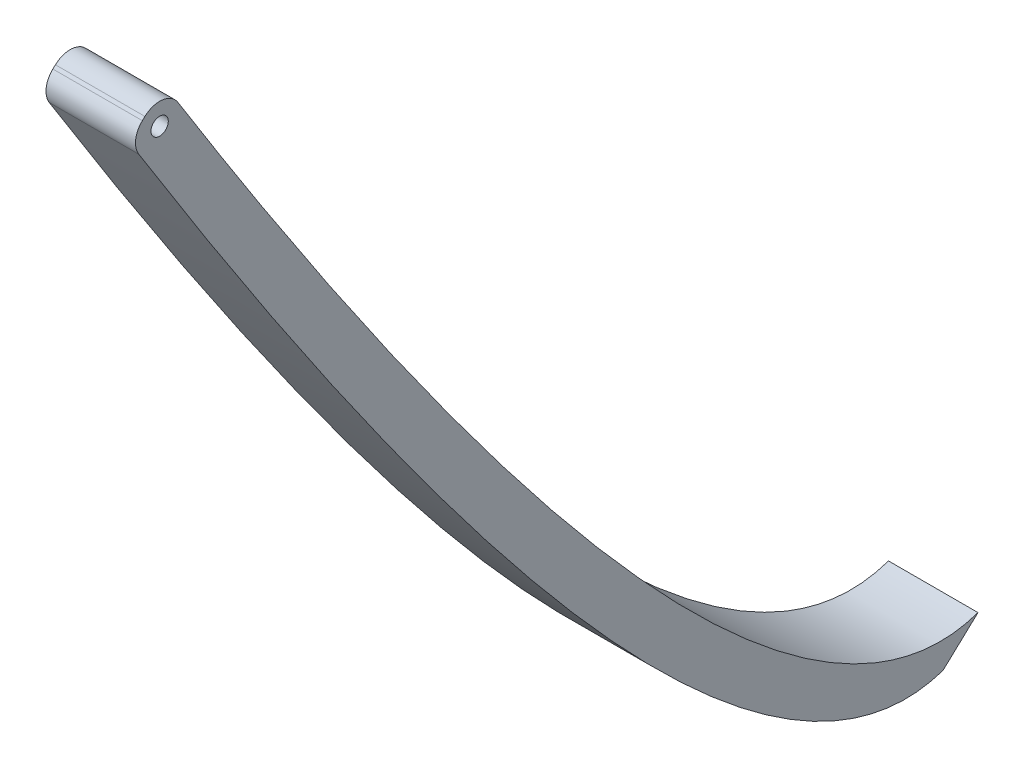
ISO-10303-21;
HEADER;
FILE_DESCRIPTION(('STEP AP214'),'2;1');
FILE_NAME('part.step','',(''),(''),'','','');
FILE_SCHEMA(('AUTOMOTIVE_DESIGN { 1 0 10303 214 1 1 1 1 }'));
ENDSEC;
DATA;
#1=APPLICATION_CONTEXT('core data for automotive mechanical design processes');
#2=APPLICATION_PROTOCOL_DEFINITION('international standard','automotive_design',2000,#1);
#3=PRODUCT_CONTEXT('',#1,'mechanical');
#4=PRODUCT('Part','Part','',(#3));
#5=PRODUCT_RELATED_PRODUCT_CATEGORY('part','',(#4));
#6=PRODUCT_DEFINITION_FORMATION('','',#4);
#7=PRODUCT_DEFINITION_CONTEXT('part definition',#1,'design');
#8=PRODUCT_DEFINITION('design','',#6,#7);
#9=PRODUCT_DEFINITION_SHAPE('','',#8);
#10=(LENGTH_UNIT() NAMED_UNIT(*) SI_UNIT(.MILLI.,.METRE.));
#11=(NAMED_UNIT(*) PLANE_ANGLE_UNIT() SI_UNIT($,.RADIAN.));
#12=(NAMED_UNIT(*) SI_UNIT($,.STERADIAN.) SOLID_ANGLE_UNIT());
#13=UNCERTAINTY_MEASURE_WITH_UNIT(LENGTH_MEASURE(1.E-05),#10,'distance_accuracy_value','');
#14=(GEOMETRIC_REPRESENTATION_CONTEXT(3) GLOBAL_UNCERTAINTY_ASSIGNED_CONTEXT((#13)) GLOBAL_UNIT_ASSIGNED_CONTEXT((#10,
#11,#12)) REPRESENTATION_CONTEXT('',''));
#15=CARTESIAN_POINT('',(0.,0.,0.));
#16=DIRECTION('',(0.,0.,1.));
#17=DIRECTION('',(1.,0.,0.));
#18=AXIS2_PLACEMENT_3D('',#15,#16,#17);
#19=CARTESIAN_POINT('',(10.52068,-1.78849990373209E-12,-1.12800394025392E-12));
#20=CARTESIAN_POINT('',(10.52068,-110.968732872422,-68.8329647294172));
#21=CARTESIAN_POINT('',(10.52068,-101.600000000002,-95.6940061903301));
#22=B_SPLINE_CURVE_WITH_KNOTS('',2,(#19,#20,#21),.UNSPECIFIED.,.F.,.F.,(3,3),
(0.0468869322633743,0.913353357478369),.UNSPECIFIED.);
#23=DIRECTION('',(-1.,0.,0.));
#24=VECTOR('',#23,1.);
#25=SURFACE_OF_LINEAR_EXTRUSION('',#22,#24);
#26=CARTESIAN_POINT('',(10.52068,-1.77682253678522,-1.1042604946298));
#27=VERTEX_POINT('',#26);
#28=CARTESIAN_POINT('',(10.52068,-101.6,-95.6940061903296));
#29=VERTEX_POINT('',#28);
#30=EDGE_CURVE('E94',#27,#29,#22,.T.);
#31=ORIENTED_EDGE('',*,*,#30,.F.);
#32=DIRECTION('',(-1.,0.,0.));
#33=VECTOR('',#32,1.);
#34=CARTESIAN_POINT('',(10.52068,-1.77682253678526,-1.10426049462983));
#35=LINE('',#34,#33);
#36=CARTESIAN_POINT('',(0.,-1.77682253678522,-1.1042604946298));
#37=VERTEX_POINT('',#36);
#38=EDGE_CURVE('E120',#27,#37,#35,.T.);
#39=ORIENTED_EDGE('',*,*,#38,.T.);
#40=CARTESIAN_POINT('',(0.,-1.78849990373209E-12,-1.12800394025392E-12));
#41=CARTESIAN_POINT('',(0.,-110.968732872422,-68.8329647294172));
#42=CARTESIAN_POINT('',(0.,-101.600000000002,-95.6940061903301));
#43=B_SPLINE_CURVE_WITH_KNOTS('',2,(#40,#41,#42),.UNSPECIFIED.,.F.,.F.,(3,3),
(0.0468869322633743,0.913353357478369),.UNSPECIFIED.);
#44=CARTESIAN_POINT('',(0.,-101.6,-95.6940061903296));
#45=VERTEX_POINT('',#44);
#46=EDGE_CURVE('E117',#37,#45,#43,.T.);
#47=ORIENTED_EDGE('',*,*,#46,.T.);
#48=DIRECTION('',(-1.,0.,0.));
#49=VECTOR('',#48,1.);
#50=CARTESIAN_POINT('',(10.52068,-101.6,-95.6940061903296));
#51=LINE('',#50,#49);
#52=EDGE_CURVE('E110',#29,#45,#51,.T.);
#53=ORIENTED_EDGE('',*,*,#52,.F.);
#54=EDGE_LOOP('',(#31,#39,#47,#53));
#55=FACE_BOUND('',#54,.T.);
#56=ADVANCED_FACE('F39',(#55),#25,.F.);
#57=CARTESIAN_POINT('',(10.52068,-101.6,-95.6940061903296));
#58=DIRECTION('',(0.,0.73173678836011,0.681587318368257));
#59=DIRECTION('',(0.,-0.681587318368257,0.73173678836011));
#60=AXIS2_PLACEMENT_3D('',#57,#58,#59);
#61=PLANE('',#60);
#62=DIRECTION('',(0.,0.681587318368257,-0.73173678836011));
#63=VECTOR('',#62,1.);
#64=CARTESIAN_POINT('',(0.,-101.6,-95.6940061903296));
#65=LINE('',#64,#63);
#66=CARTESIAN_POINT('',(0.,-97.7912900649608,-99.7829513636856));
#67=VERTEX_POINT('',#66);
#68=EDGE_CURVE('E157',#45,#67,#65,.T.);
#69=ORIENTED_EDGE('',*,*,#68,.T.);
#70=DIRECTION('',(-1.,0.,0.));
#71=VECTOR('',#70,1.);
#72=CARTESIAN_POINT('',(10.52068,-97.7912900649608,-99.7829513636856));
#73=LINE('',#72,#71);
#74=CARTESIAN_POINT('',(10.52068,-97.7912900649608,-99.7829513636856));
#75=VERTEX_POINT('',#74);
#76=EDGE_CURVE('E112',#75,#67,#73,.T.);
#77=ORIENTED_EDGE('',*,*,#76,.F.);
#78=DIRECTION('',(0.,0.681587318368257,-0.73173678836011));
#79=VECTOR('',#78,1.);
#80=CARTESIAN_POINT('',(10.52068,-101.6,-95.6940061903296));
#81=LINE('',#80,#79);
#82=EDGE_CURVE('E97',#29,#75,#81,.T.);
#83=ORIENTED_EDGE('',*,*,#82,.F.);
#84=ORIENTED_EDGE('',*,*,#52,.T.);
#85=EDGE_LOOP('',(#69,#77,#83,#84));
#86=FACE_BOUND('',#85,.T.);
#87=ADVANCED_FACE('F109',(#86),#61,.F.);
#88=CARTESIAN_POINT('',(10.52068,-97.7912900649608,-99.7829513636856));
#89=CARTESIAN_POINT('',(10.52068,-107.16002293738,-72.9219099027734));
#90=CARTESIAN_POINT('',(10.52068,3.80870993503443,-4.08894517336165));
#91=B_SPLINE_CURVE_WITH_KNOTS('',2,(#88,#89,#90),.UNSPECIFIED.,.F.,.F.,(3,3),
(0.0468869322633991,0.913353357478373),.UNSPECIFIED.);
#92=DIRECTION('',(-1.,0.,0.));
#93=VECTOR('',#92,1.);
#94=SURFACE_OF_LINEAR_EXTRUSION('',#91,#93);
#95=CARTESIAN_POINT('',(0.,-97.7912900649608,-99.7829513636856));
#96=CARTESIAN_POINT('',(0.,-107.16002293738,-72.9219099027734));
#97=CARTESIAN_POINT('',(0.,3.80870993503443,-4.08894517336165));
#98=B_SPLINE_CURVE_WITH_KNOTS('',2,(#95,#96,#97),.UNSPECIFIED.,.F.,.F.,(3,3),
(0.0468869322633991,0.913353357478373),.UNSPECIFIED.);
#99=CARTESIAN_POINT('',(0.,1.19119104288507,-5.71717367150983));
#100=VERTEX_POINT('',#99);
#101=EDGE_CURVE('E154',#67,#100,#98,.T.);
#102=ORIENTED_EDGE('',*,*,#101,.T.);
#103=DIRECTION('',(-1.,0.,0.));
#104=VECTOR('',#103,1.);
#105=CARTESIAN_POINT('',(0.,1.19119104288406,-5.71717367151046));
#106=LINE('',#105,#104);
#107=CARTESIAN_POINT('',(10.52068,1.19119104288507,-5.71717367150983));
#108=VERTEX_POINT('',#107);
#109=EDGE_CURVE('E11',#100,#108,#106,.F.);
#110=ORIENTED_EDGE('',*,*,#109,.T.);
#111=EDGE_CURVE('E114',#75,#108,#91,.T.);
#112=ORIENTED_EDGE('',*,*,#111,.F.);
#113=ORIENTED_EDGE('',*,*,#76,.T.);
#114=EDGE_LOOP('',(#102,#110,#112,#113));
#115=FACE_BOUND('',#114,.T.);
#116=ADVANCED_FACE('F155',(#115),#94,.F.);
#117=CARTESIAN_POINT('',(10.52068,0.,0.));
#118=DIRECTION('',(0.,-0.731736788360962,-0.681587318367342));
#119=DIRECTION('',(0.,0.681587318367342,-0.731736788360962));
#120=AXIS2_PLACEMENT_3D('',#117,#118,#119);
#121=PLANE('',#120);
#122=DIRECTION('',(0.,-0.681587318367342,0.731736788360962));
#123=VECTOR('',#122,1.);
#124=CARTESIAN_POINT('',(0.,0.,0.));
#125=LINE('',#124,#123);
#126=CARTESIAN_POINT('',(0.,1.7054155825063,-1.83089574517484));
#127=VERTEX_POINT('',#126);
#128=CARTESIAN_POINT('',(0.,1.42438696356587,-1.52918975165142));
#129=VERTEX_POINT('',#128);
#130=EDGE_CURVE('E105',#127,#129,#125,.T.);
#131=ORIENTED_EDGE('',*,*,#130,.T.);
#132=DIRECTION('',(-1.,0.,0.));
#133=VECTOR('',#132,1.);
#134=CARTESIAN_POINT('',(10.52068,1.42438696356587,-1.52918975165142));
#135=LINE('',#134,#133);
#136=CARTESIAN_POINT('',(10.52068,1.42438696356587,-1.52918975165142));
#137=VERTEX_POINT('',#136);
#138=EDGE_CURVE('E61',#129,#137,#135,.F.);
#139=ORIENTED_EDGE('',*,*,#138,.T.);
#140=DIRECTION('',(0.,-0.681587318367342,0.731736788360962));
#141=VECTOR('',#140,1.);
#142=CARTESIAN_POINT('',(10.52068,0.,0.));
#143=LINE('',#142,#141);
#144=CARTESIAN_POINT('',(10.52068,1.7054155825063,-1.83089574517484));
#145=VERTEX_POINT('',#144);
#146=EDGE_CURVE('E126',#145,#137,#143,.T.);
#147=ORIENTED_EDGE('',*,*,#146,.F.);
#148=DIRECTION('',(-1.,0.,0.));
#149=VECTOR('',#148,1.);
#150=CARTESIAN_POINT('',(10.52068,1.7054155825063,-1.83089574517484));
#151=LINE('',#150,#149);
#152=EDGE_CURVE('E135',#145,#127,#151,.T.);
#153=ORIENTED_EDGE('',*,*,#152,.T.);
#154=EDGE_LOOP('',(#131,#139,#147,#153));
#155=FACE_BOUND('',#154,.T.);
#156=ADVANCED_FACE('F147',(#155),#121,.F.);
#157=CARTESIAN_POINT('',(10.52068,-80.8843664362117,-58.3399839122914));
#158=DIRECTION('',(-1.,0.,0.));
#159=DIRECTION('',(0.,0.,1.));
#160=AXIS2_PLACEMENT_3D('',#157,#158,#159);
#161=PLANE('',#160);
#162=CARTESIAN_POINT('',(10.52068,-0.153195859930535,-3.56212753382788));
#163=DIRECTION('',(-1.,0.,0.));
#164=DIRECTION('',(0.,0.,1.));
#165=AXIS2_PLACEMENT_3D('',#162,#163,#164);
#166=CIRCLE('',#165,1.016);
#167=CARTESIAN_POINT('',(10.52068,-0.153195859930535,-2.54612753382788));
#168=VERTEX_POINT('',#167);
#169=EDGE_CURVE('E171',#168,#168,#166,.T.);
#170=ORIENTED_EDGE('',*,*,#169,.T.);
#171=EDGE_LOOP('',(#170));
#172=FACE_BOUND('',#171,.T.);
#173=ORIENTED_EDGE('',*,*,#146,.T.);
#174=CARTESIAN_POINT('',(10.52068,-0.434224478870971,-3.26042154030447));
#175=DIRECTION('',(-1.,0.,0.));
#176=DIRECTION('',(0.,0.,1.));
#177=AXIS2_PLACEMENT_3D('',#174,#175,#176);
#178=CIRCLE('',#177,2.54);
#179=EDGE_CURVE('E48',#137,#27,#178,.F.);
#180=ORIENTED_EDGE('',*,*,#179,.T.);
#181=ORIENTED_EDGE('',*,*,#30,.T.);
#182=ORIENTED_EDGE('',*,*,#82,.T.);
#183=ORIENTED_EDGE('',*,*,#111,.T.);
#184=CARTESIAN_POINT('',(10.52068,-0.153195859930535,-3.56212753382788));
#185=DIRECTION('',(-1.,0.,0.));
#186=DIRECTION('',(0.,0.,1.));
#187=AXIS2_PLACEMENT_3D('',#184,#185,#186);
#188=CIRCLE('',#187,2.54);
#189=EDGE_CURVE('E141',#108,#145,#188,.F.);
#190=ORIENTED_EDGE('',*,*,#189,.T.);
#191=EDGE_LOOP('',(#173,#180,#181,#182,#183,#190));
#192=FACE_BOUND('',#191,.T.);
#193=ADVANCED_FACE('F96',(#172,#192),#161,.F.);
#194=CARTESIAN_POINT('',(0.,-80.8843664362117,-58.3399839122914));
#195=DIRECTION('',(-1.,0.,0.));
#196=DIRECTION('',(0.,0.,1.));
#197=AXIS2_PLACEMENT_3D('',#194,#195,#196);
#198=PLANE('',#197);
#199=CARTESIAN_POINT('',(0.,-0.153195859930535,-3.56212753382788));
#200=DIRECTION('',(-1.,0.,0.));
#201=DIRECTION('',(0.,0.,1.));
#202=AXIS2_PLACEMENT_3D('',#199,#200,#201);
#203=CIRCLE('',#202,1.016);
#204=CARTESIAN_POINT('',(0.,-0.153195859930535,-2.54612753382788));
#205=VERTEX_POINT('',#204);
#206=EDGE_CURVE('E196',#205,#205,#203,.T.);
#207=ORIENTED_EDGE('',*,*,#206,.F.);
#208=EDGE_LOOP('',(#207));
#209=FACE_BOUND('',#208,.T.);
#210=ORIENTED_EDGE('',*,*,#46,.F.);
#211=CARTESIAN_POINT('',(0.,-0.434224478870971,-3.26042154030447));
#212=DIRECTION('',(-1.,0.,0.));
#213=DIRECTION('',(0.,0.,1.));
#214=AXIS2_PLACEMENT_3D('',#211,#212,#213);
#215=CIRCLE('',#214,2.54);
#216=EDGE_CURVE('E132',#37,#129,#215,.T.);
#217=ORIENTED_EDGE('',*,*,#216,.T.);
#218=ORIENTED_EDGE('',*,*,#130,.F.);
#219=CARTESIAN_POINT('',(0.,-0.153195859930535,-3.56212753382788));
#220=DIRECTION('',(-1.,0.,0.));
#221=DIRECTION('',(0.,0.,1.));
#222=AXIS2_PLACEMENT_3D('',#219,#220,#221);
#223=CIRCLE('',#222,2.54);
#224=EDGE_CURVE('E124',#127,#100,#223,.T.);
#225=ORIENTED_EDGE('',*,*,#224,.T.);
#226=ORIENTED_EDGE('',*,*,#101,.F.);
#227=ORIENTED_EDGE('',*,*,#68,.F.);
#228=EDGE_LOOP('',(#210,#217,#218,#225,#226,#227));
#229=FACE_BOUND('',#228,.T.);
#230=ADVANCED_FACE('F153',(#209,#229),#198,.T.);
#231=CARTESIAN_POINT('',(5.26034,-0.434224478870971,-3.26042154030447));
#232=DIRECTION('',(-1.,0.,0.));
#233=DIRECTION('',(0.,0.,1.));
#234=AXIS2_PLACEMENT_3D('',#231,#232,#233);
#235=CYLINDRICAL_SURFACE('',#234,2.54);
#236=ORIENTED_EDGE('',*,*,#179,.F.);
#237=ORIENTED_EDGE('',*,*,#138,.F.);
#238=ORIENTED_EDGE('',*,*,#216,.F.);
#239=ORIENTED_EDGE('',*,*,#38,.F.);
#240=EDGE_LOOP('',(#236,#237,#238,#239));
#241=FACE_BOUND('',#240,.T.);
#242=ADVANCED_FACE('F191',(#241),#235,.T.);
#243=CARTESIAN_POINT('',(5.26034,-0.153195859930535,-3.56212753382788));
#244=DIRECTION('',(-1.,0.,0.));
#245=DIRECTION('',(0.,0.,1.));
#246=AXIS2_PLACEMENT_3D('',#243,#244,#245);
#247=CYLINDRICAL_SURFACE('',#246,2.54);
#248=ORIENTED_EDGE('',*,*,#189,.F.);
#249=ORIENTED_EDGE('',*,*,#109,.F.);
#250=ORIENTED_EDGE('',*,*,#224,.F.);
#251=ORIENTED_EDGE('',*,*,#152,.F.);
#252=EDGE_LOOP('',(#248,#249,#250,#251));
#253=FACE_BOUND('',#252,.T.);
#254=ADVANCED_FACE('F41',(#253),#247,.T.);
#255=CARTESIAN_POINT('',(10.52068,-0.153195859930535,-3.56212753382788));
#256=DIRECTION('',(-1.,0.,0.));
#257=DIRECTION('',(0.,0.,1.));
#258=AXIS2_PLACEMENT_3D('',#255,#256,#257);
#259=CYLINDRICAL_SURFACE('',#258,1.016);
#260=ORIENTED_EDGE('',*,*,#169,.F.);
#261=EDGE_LOOP('',(#260));
#262=FACE_BOUND('',#261,.T.);
#263=ORIENTED_EDGE('',*,*,#206,.T.);
#264=EDGE_LOOP('',(#263));
#265=FACE_BOUND('',#264,.T.);
#266=ADVANCED_FACE('F208',(#262,#265),#259,.F.);
#267=CLOSED_SHELL('',(#56,#87,#116,#156,#193,#230,#242,#254,#266));
#268=MANIFOLD_SOLID_BREP('B2',#267);
#269=ADVANCED_BREP_SHAPE_REPRESENTATION('',(#18,#268),#14);
#270=SHAPE_DEFINITION_REPRESENTATION(#9,#269);
ENDSEC;
END-ISO-10303-21;
